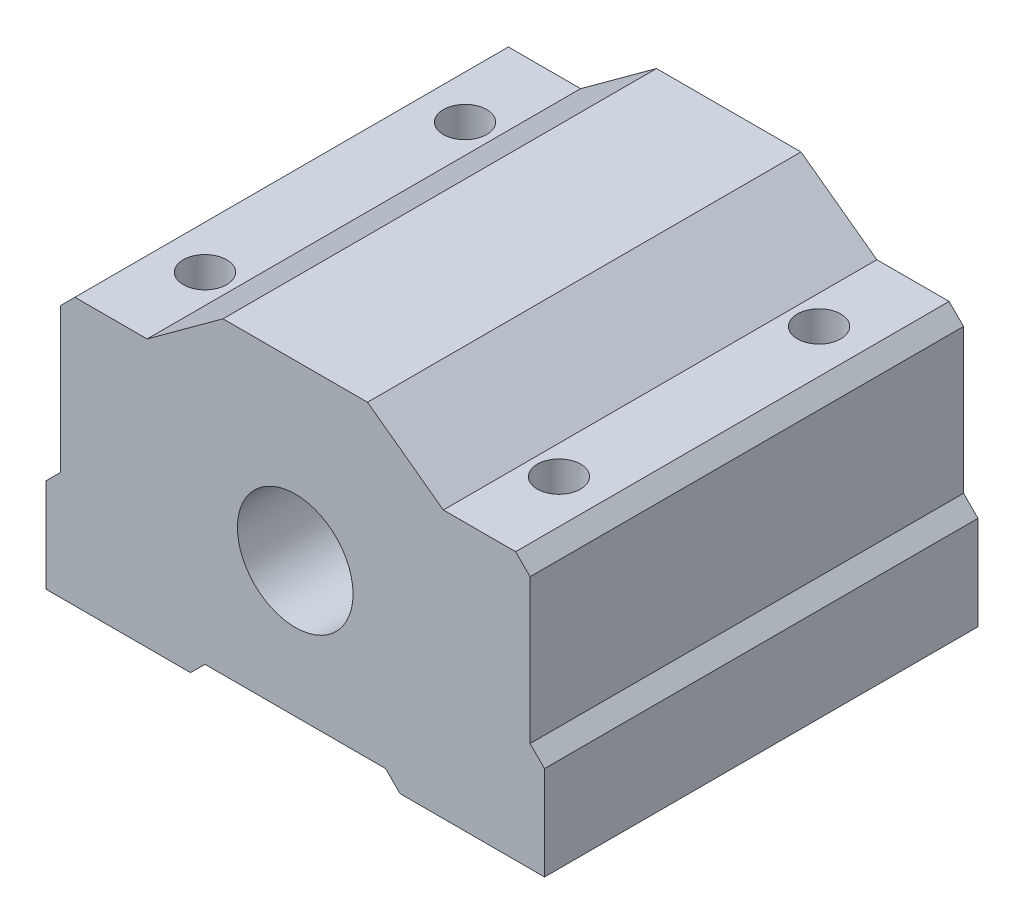
ISO-10303-21;
HEADER;
FILE_DESCRIPTION(('STEP AP214'),'2;1');
FILE_NAME('part.step','',(''),(''),'','','');
FILE_SCHEMA(('AUTOMOTIVE_DESIGN { 1 0 10303 214 1 1 1 1 }'));
ENDSEC;
DATA;
#1=APPLICATION_CONTEXT('core data for automotive mechanical design processes');
#2=APPLICATION_PROTOCOL_DEFINITION('international standard','automotive_design',2000,#1);
#3=PRODUCT_CONTEXT('',#1,'mechanical');
#4=PRODUCT('Part','Part','',(#3));
#5=PRODUCT_RELATED_PRODUCT_CATEGORY('part','',(#4));
#6=PRODUCT_DEFINITION_FORMATION('','',#4);
#7=PRODUCT_DEFINITION_CONTEXT('part definition',#1,'design');
#8=PRODUCT_DEFINITION('design','',#6,#7);
#9=PRODUCT_DEFINITION_SHAPE('','',#8);
#10=(LENGTH_UNIT() NAMED_UNIT(*) SI_UNIT(.MILLI.,.METRE.));
#11=(NAMED_UNIT(*) PLANE_ANGLE_UNIT() SI_UNIT($,.RADIAN.));
#12=(NAMED_UNIT(*) SI_UNIT($,.STERADIAN.) SOLID_ANGLE_UNIT());
#13=UNCERTAINTY_MEASURE_WITH_UNIT(LENGTH_MEASURE(1.E-05),#10,'distance_accuracy_value','');
#14=(GEOMETRIC_REPRESENTATION_CONTEXT(3) GLOBAL_UNCERTAINTY_ASSIGNED_CONTEXT((#13)) GLOBAL_UNIT_ASSIGNED_CONTEXT((#10,
#11,#12)) REPRESENTATION_CONTEXT('',''));
#15=CARTESIAN_POINT('',(0.,0.,0.));
#16=DIRECTION('',(0.,0.,1.));
#17=DIRECTION('',(1.,0.,0.));
#18=AXIS2_PLACEMENT_3D('',#15,#16,#17);
#19=CARTESIAN_POINT('',(-4.99999999999999,21.332427429189,30.));
#20=DIRECTION('',(0.589604219875227,-0.807692307692307,0.));
#21=DIRECTION('',(0.807692307692307,0.589604219875227,0.));
#22=AXIS2_PLACEMENT_3D('',#19,#20,#21);
#23=PLANE('',#22);
#24=DIRECTION('',(-0.807692307692307,-0.589604219875227,0.));
#25=VECTOR('',#24,1.);
#26=CARTESIAN_POINT('',(-4.99999999999999,21.332427429189,0.));
#27=LINE('',#26,#25);
#28=CARTESIAN_POINT('',(-4.99999999999999,21.332427429189,0.));
#29=VERTEX_POINT('',#28);
#30=CARTESIAN_POINT('',(-10.25,17.5,0.));
#31=VERTEX_POINT('',#30);
#32=EDGE_CURVE('E191',#29,#31,#27,.T.);
#33=ORIENTED_EDGE('',*,*,#32,.T.);
#34=DIRECTION('',(0.,0.,-1.));
#35=VECTOR('',#34,1.);
#36=CARTESIAN_POINT('',(-10.25,17.5,30.));
#37=LINE('',#36,#35);
#38=CARTESIAN_POINT('',(-10.25,17.5,30.));
#39=VERTEX_POINT('',#38);
#40=EDGE_CURVE('E11',#39,#31,#37,.T.);
#41=ORIENTED_EDGE('',*,*,#40,.F.);
#42=DIRECTION('',(-0.807692307692307,-0.589604219875227,0.));
#43=VECTOR('',#42,1.);
#44=CARTESIAN_POINT('',(-4.99999999999999,21.332427429189,30.));
#45=LINE('',#44,#43);
#46=CARTESIAN_POINT('',(-4.99999999999999,21.332427429189,30.));
#47=VERTEX_POINT('',#46);
#48=EDGE_CURVE('E227',#47,#39,#45,.T.);
#49=ORIENTED_EDGE('',*,*,#48,.F.);
#50=DIRECTION('',(0.,0.,-1.));
#51=VECTOR('',#50,1.);
#52=CARTESIAN_POINT('',(-4.99999999999999,21.332427429189,30.));
#53=LINE('',#52,#51);
#54=EDGE_CURVE('E187',#47,#29,#53,.T.);
#55=ORIENTED_EDGE('',*,*,#54,.T.);
#56=EDGE_LOOP('',(#33,#41,#49,#55));
#57=FACE_BOUND('',#56,.T.);
#58=ADVANCED_FACE('F35',(#57),#23,.F.);
#59=CARTESIAN_POINT('',(-10.25,17.5,30.));
#60=DIRECTION('',(0.,-1.,0.));
#61=DIRECTION('',(0.,0.,-1.));
#62=AXIS2_PLACEMENT_3D('',#59,#60,#61);
#63=PLANE('',#62);
#64=CARTESIAN_POINT('',(-12.25,17.5,24.));
#65=DIRECTION('',(0.,-1.,0.));
#66=DIRECTION('',(0.,0.,1.));
#67=AXIS2_PLACEMENT_3D('',#64,#65,#66);
#68=CIRCLE('',#67,1.5);
#69=CARTESIAN_POINT('',(-12.25,17.5,25.5));
#70=VERTEX_POINT('',#69);
#71=EDGE_CURVE('E449',#70,#70,#68,.T.);
#72=ORIENTED_EDGE('',*,*,#71,.T.);
#73=EDGE_LOOP('',(#72));
#74=FACE_BOUND('',#73,.T.);
#75=CARTESIAN_POINT('',(-12.25,17.5,6.));
#76=DIRECTION('',(0.,-1.,0.));
#77=DIRECTION('',(0.,0.,1.));
#78=AXIS2_PLACEMENT_3D('',#75,#76,#77);
#79=CIRCLE('',#78,1.5);
#80=CARTESIAN_POINT('',(-12.25,17.5,7.5));
#81=VERTEX_POINT('',#80);
#82=EDGE_CURVE('E451',#81,#81,#79,.T.);
#83=ORIENTED_EDGE('',*,*,#82,.T.);
#84=EDGE_LOOP('',(#83));
#85=FACE_BOUND('',#84,.T.);
#86=DIRECTION('',(-1.,0.,0.));
#87=VECTOR('',#86,1.);
#88=CARTESIAN_POINT('',(-10.25,17.5,0.));
#89=LINE('',#88,#87);
#90=CARTESIAN_POINT('',(-15.25,17.5,0.));
#91=VERTEX_POINT('',#90);
#92=EDGE_CURVE('E194',#31,#91,#89,.T.);
#93=ORIENTED_EDGE('',*,*,#92,.T.);
#94=DIRECTION('',(0.,0.,-1.));
#95=VECTOR('',#94,1.);
#96=CARTESIAN_POINT('',(-15.25,17.5,30.));
#97=LINE('',#96,#95);
#98=CARTESIAN_POINT('',(-15.25,17.5,30.));
#99=VERTEX_POINT('',#98);
#100=EDGE_CURVE('E43',#99,#91,#97,.T.);
#101=ORIENTED_EDGE('',*,*,#100,.F.);
#102=DIRECTION('',(-1.,0.,0.));
#103=VECTOR('',#102,1.);
#104=CARTESIAN_POINT('',(-10.25,17.5,30.));
#105=LINE('',#104,#103);
#106=EDGE_CURVE('E124',#39,#99,#105,.T.);
#107=ORIENTED_EDGE('',*,*,#106,.F.);
#108=ORIENTED_EDGE('',*,*,#40,.T.);
#109=EDGE_LOOP('',(#93,#101,#107,#108));
#110=FACE_BOUND('',#109,.T.);
#111=ADVANCED_FACE('F336',(#74,#85,#110),#63,.F.);
#112=CARTESIAN_POINT('',(-15.25,17.5,30.));
#113=DIRECTION('',(0.707106781186549,-0.707106781186546,0.));
#114=DIRECTION('',(0.707106781186546,0.707106781186549,0.));
#115=AXIS2_PLACEMENT_3D('',#112,#113,#114);
#116=PLANE('',#115);
#117=DIRECTION('',(-0.707106781186546,-0.707106781186549,0.));
#118=VECTOR('',#117,1.);
#119=CARTESIAN_POINT('',(-15.25,17.5,0.));
#120=LINE('',#119,#118);
#121=CARTESIAN_POINT('',(-16.25,16.5,0.));
#122=VERTEX_POINT('',#121);
#123=EDGE_CURVE('E197',#91,#122,#120,.T.);
#124=ORIENTED_EDGE('',*,*,#123,.T.);
#125=DIRECTION('',(0.,0.,-1.));
#126=VECTOR('',#125,1.);
#127=CARTESIAN_POINT('',(-16.25,16.5,30.));
#128=LINE('',#127,#126);
#129=CARTESIAN_POINT('',(-16.25,16.5,30.));
#130=VERTEX_POINT('',#129);
#131=EDGE_CURVE('E264',#130,#122,#128,.T.);
#132=ORIENTED_EDGE('',*,*,#131,.F.);
#133=DIRECTION('',(-0.707106781186546,-0.707106781186549,0.));
#134=VECTOR('',#133,1.);
#135=CARTESIAN_POINT('',(-15.25,17.5,30.));
#136=LINE('',#135,#134);
#137=EDGE_CURVE('E272',#99,#130,#136,.T.);
#138=ORIENTED_EDGE('',*,*,#137,.F.);
#139=ORIENTED_EDGE('',*,*,#100,.T.);
#140=EDGE_LOOP('',(#124,#132,#138,#139));
#141=FACE_BOUND('',#140,.T.);
#142=ADVANCED_FACE('F270',(#141),#116,.F.);
#143=CARTESIAN_POINT('',(-16.25,16.5,30.));
#144=DIRECTION('',(1.,0.,0.));
#145=DIRECTION('',(0.,1.,0.));
#146=AXIS2_PLACEMENT_3D('',#143,#144,#145);
#147=PLANE('',#146);
#148=DIRECTION('',(0.,-1.,0.));
#149=VECTOR('',#148,1.);
#150=CARTESIAN_POINT('',(-16.25,16.5,0.));
#151=LINE('',#150,#149);
#152=CARTESIAN_POINT('',(-16.25,6.50000000000001,0.));
#153=VERTEX_POINT('',#152);
#154=EDGE_CURVE('E199',#122,#153,#151,.T.);
#155=ORIENTED_EDGE('',*,*,#154,.T.);
#156=DIRECTION('',(0.,0.,-1.));
#157=VECTOR('',#156,1.);
#158=CARTESIAN_POINT('',(-16.25,6.50000000000001,30.));
#159=LINE('',#158,#157);
#160=CARTESIAN_POINT('',(-16.25,6.50000000000001,30.));
#161=VERTEX_POINT('',#160);
#162=EDGE_CURVE('E261',#161,#153,#159,.T.);
#163=ORIENTED_EDGE('',*,*,#162,.F.);
#164=DIRECTION('',(0.,-1.,0.));
#165=VECTOR('',#164,1.);
#166=CARTESIAN_POINT('',(-16.25,16.5,30.));
#167=LINE('',#166,#165);
#168=EDGE_CURVE('E290',#130,#161,#167,.T.);
#169=ORIENTED_EDGE('',*,*,#168,.F.);
#170=ORIENTED_EDGE('',*,*,#131,.T.);
#171=EDGE_LOOP('',(#155,#163,#169,#170));
#172=FACE_BOUND('',#171,.T.);
#173=ADVANCED_FACE('F281',(#172),#147,.F.);
#174=CARTESIAN_POINT('',(-16.25,6.50000000000001,30.));
#175=DIRECTION('',(0.70710678118655,-0.707106781186545,0.));
#176=DIRECTION('',(0.707106781186545,0.70710678118655,0.));
#177=AXIS2_PLACEMENT_3D('',#174,#175,#176);
#178=PLANE('',#177);
#179=DIRECTION('',(-0.707106781186545,-0.70710678118655,0.));
#180=VECTOR('',#179,1.);
#181=CARTESIAN_POINT('',(-16.25,6.50000000000001,0.));
#182=LINE('',#181,#180);
#183=CARTESIAN_POINT('',(-17.25,5.5,0.));
#184=VERTEX_POINT('',#183);
#185=EDGE_CURVE('E201',#153,#184,#182,.T.);
#186=ORIENTED_EDGE('',*,*,#185,.T.);
#187=DIRECTION('',(0.,0.,-1.));
#188=VECTOR('',#187,1.);
#189=CARTESIAN_POINT('',(-17.25,5.5,30.));
#190=LINE('',#189,#188);
#191=CARTESIAN_POINT('',(-17.25,5.5,30.));
#192=VERTEX_POINT('',#191);
#193=EDGE_CURVE('E258',#192,#184,#190,.T.);
#194=ORIENTED_EDGE('',*,*,#193,.F.);
#195=DIRECTION('',(-0.707106781186545,-0.70710678118655,0.));
#196=VECTOR('',#195,1.);
#197=CARTESIAN_POINT('',(-16.25,6.50000000000001,30.));
#198=LINE('',#197,#196);
#199=EDGE_CURVE('E287',#161,#192,#198,.T.);
#200=ORIENTED_EDGE('',*,*,#199,.F.);
#201=ORIENTED_EDGE('',*,*,#162,.T.);
#202=EDGE_LOOP('',(#186,#194,#200,#201));
#203=FACE_BOUND('',#202,.T.);
#204=ADVANCED_FACE('F285',(#203),#178,.F.);
#205=CARTESIAN_POINT('',(-17.25,5.5,30.));
#206=DIRECTION('',(1.,0.,0.));
#207=DIRECTION('',(0.,1.,0.));
#208=AXIS2_PLACEMENT_3D('',#205,#206,#207);
#209=PLANE('',#208);
#210=DIRECTION('',(0.,-1.,0.));
#211=VECTOR('',#210,1.);
#212=CARTESIAN_POINT('',(-17.25,5.5,0.));
#213=LINE('',#212,#211);
#214=CARTESIAN_POINT('',(-17.25,-1.,0.));
#215=VERTEX_POINT('',#214);
#216=EDGE_CURVE('E203',#184,#215,#213,.T.);
#217=ORIENTED_EDGE('',*,*,#216,.T.);
#218=DIRECTION('',(0.,0.,-1.));
#219=VECTOR('',#218,1.);
#220=CARTESIAN_POINT('',(-17.25,-1.,30.));
#221=LINE('',#220,#219);
#222=CARTESIAN_POINT('',(-17.25,-1.,30.));
#223=VERTEX_POINT('',#222);
#224=EDGE_CURVE('E255',#223,#215,#221,.T.);
#225=ORIENTED_EDGE('',*,*,#224,.F.);
#226=DIRECTION('',(0.,-1.,0.));
#227=VECTOR('',#226,1.);
#228=CARTESIAN_POINT('',(-17.25,5.5,30.));
#229=LINE('',#228,#227);
#230=EDGE_CURVE('E289',#192,#223,#229,.T.);
#231=ORIENTED_EDGE('',*,*,#230,.F.);
#232=ORIENTED_EDGE('',*,*,#193,.T.);
#233=EDGE_LOOP('',(#217,#225,#231,#232));
#234=FACE_BOUND('',#233,.T.);
#235=ADVANCED_FACE('F352',(#234),#209,.F.);
#236=CARTESIAN_POINT('',(-17.25,-1.,30.));
#237=DIRECTION('',(0.,1.,0.));
#238=DIRECTION('',(0.,0.,1.));
#239=AXIS2_PLACEMENT_3D('',#236,#237,#238);
#240=PLANE('',#239);
#241=CARTESIAN_POINT('',(-12.25,-1.,24.));
#242=DIRECTION('',(0.,-1.,0.));
#243=DIRECTION('',(0.,0.,1.));
#244=AXIS2_PLACEMENT_3D('',#241,#242,#243);
#245=CIRCLE('',#244,1.5);
#246=CARTESIAN_POINT('',(-12.25,-1.,25.5));
#247=VERTEX_POINT('',#246);
#248=EDGE_CURVE('E447',#247,#247,#245,.T.);
#249=ORIENTED_EDGE('',*,*,#248,.F.);
#250=EDGE_LOOP('',(#249));
#251=FACE_BOUND('',#250,.T.);
#252=CARTESIAN_POINT('',(-12.25,-1.,6.));
#253=DIRECTION('',(0.,-1.,0.));
#254=DIRECTION('',(0.,0.,1.));
#255=AXIS2_PLACEMENT_3D('',#252,#253,#254);
#256=CIRCLE('',#255,1.5);
#257=CARTESIAN_POINT('',(-12.25,-1.,7.5));
#258=VERTEX_POINT('',#257);
#259=EDGE_CURVE('E454',#258,#258,#256,.T.);
#260=ORIENTED_EDGE('',*,*,#259,.F.);
#261=EDGE_LOOP('',(#260));
#262=FACE_BOUND('',#261,.T.);
#263=DIRECTION('',(1.,0.,0.));
#264=VECTOR('',#263,1.);
#265=CARTESIAN_POINT('',(-17.25,-1.,0.));
#266=LINE('',#265,#264);
#267=CARTESIAN_POINT('',(-7.25,-1.,0.));
#268=VERTEX_POINT('',#267);
#269=EDGE_CURVE('E205',#215,#268,#266,.T.);
#270=ORIENTED_EDGE('',*,*,#269,.T.);
#271=DIRECTION('',(0.,0.,-1.));
#272=VECTOR('',#271,1.);
#273=CARTESIAN_POINT('',(-7.25,-1.,30.));
#274=LINE('',#273,#272);
#275=CARTESIAN_POINT('',(-7.25,-1.,30.));
#276=VERTEX_POINT('',#275);
#277=EDGE_CURVE('E252',#276,#268,#274,.T.);
#278=ORIENTED_EDGE('',*,*,#277,.F.);
#279=DIRECTION('',(1.,0.,0.));
#280=VECTOR('',#279,1.);
#281=CARTESIAN_POINT('',(-17.25,-1.,30.));
#282=LINE('',#281,#280);
#283=EDGE_CURVE('E292',#223,#276,#282,.T.);
#284=ORIENTED_EDGE('',*,*,#283,.F.);
#285=ORIENTED_EDGE('',*,*,#224,.T.);
#286=EDGE_LOOP('',(#270,#278,#284,#285));
#287=FACE_BOUND('',#286,.T.);
#288=ADVANCED_FACE('F355',(#251,#262,#287),#240,.F.);
#289=CARTESIAN_POINT('',(-7.25,-1.,30.));
#290=DIRECTION('',(-0.707106781186549,0.707106781186546,0.));
#291=DIRECTION('',(-0.707106781186546,-0.707106781186549,0.));
#292=AXIS2_PLACEMENT_3D('',#289,#290,#291);
#293=PLANE('',#292);
#294=DIRECTION('',(0.707106781186546,0.707106781186549,0.));
#295=VECTOR('',#294,1.);
#296=CARTESIAN_POINT('',(-7.25,-1.,0.));
#297=LINE('',#296,#295);
#298=CARTESIAN_POINT('',(-6.25,0.,0.));
#299=VERTEX_POINT('',#298);
#300=EDGE_CURVE('E207',#268,#299,#297,.T.);
#301=ORIENTED_EDGE('',*,*,#300,.T.);
#302=DIRECTION('',(0.,0.,-1.));
#303=VECTOR('',#302,1.);
#304=CARTESIAN_POINT('',(-6.25,0.,30.));
#305=LINE('',#304,#303);
#306=CARTESIAN_POINT('',(-6.25,0.,30.));
#307=VERTEX_POINT('',#306);
#308=EDGE_CURVE('E249',#307,#299,#305,.T.);
#309=ORIENTED_EDGE('',*,*,#308,.F.);
#310=DIRECTION('',(0.707106781186546,0.707106781186549,0.));
#311=VECTOR('',#310,1.);
#312=CARTESIAN_POINT('',(-7.25,-1.,30.));
#313=LINE('',#312,#311);
#314=EDGE_CURVE('E298',#276,#307,#313,.T.);
#315=ORIENTED_EDGE('',*,*,#314,.F.);
#316=ORIENTED_EDGE('',*,*,#277,.T.);
#317=EDGE_LOOP('',(#301,#309,#315,#316));
#318=FACE_BOUND('',#317,.T.);
#319=ADVANCED_FACE('F359',(#318),#293,.F.);
#320=CARTESIAN_POINT('',(0.,0.,30.));
#321=DIRECTION('',(0.,1.,0.));
#322=DIRECTION('',(0.,0.,1.));
#323=AXIS2_PLACEMENT_3D('',#320,#321,#322);
#324=PLANE('',#323);
#325=DIRECTION('',(1.,0.,0.));
#326=VECTOR('',#325,1.);
#327=CARTESIAN_POINT('',(0.,0.,0.));
#328=LINE('',#327,#326);
#329=CARTESIAN_POINT('',(6.25,0.,0.));
#330=VERTEX_POINT('',#329);
#331=EDGE_CURVE('E210',#299,#330,#328,.T.);
#332=ORIENTED_EDGE('',*,*,#331,.T.);
#333=DIRECTION('',(0.,0.,-1.));
#334=VECTOR('',#333,1.);
#335=CARTESIAN_POINT('',(6.25,0.,30.));
#336=LINE('',#335,#334);
#337=CARTESIAN_POINT('',(6.25,0.,30.));
#338=VERTEX_POINT('',#337);
#339=EDGE_CURVE('E246',#338,#330,#336,.T.);
#340=ORIENTED_EDGE('',*,*,#339,.F.);
#341=DIRECTION('',(1.,0.,0.));
#342=VECTOR('',#341,1.);
#343=CARTESIAN_POINT('',(-6.25,0.,30.));
#344=LINE('',#343,#342);
#345=EDGE_CURVE('E300',#307,#338,#344,.T.);
#346=ORIENTED_EDGE('',*,*,#345,.F.);
#347=ORIENTED_EDGE('',*,*,#308,.T.);
#348=EDGE_LOOP('',(#332,#340,#346,#347));
#349=FACE_BOUND('',#348,.T.);
#350=ADVANCED_FACE('F363',(#349),#324,.F.);
#351=CARTESIAN_POINT('',(6.25,0.,30.));
#352=DIRECTION('',(0.707106781186548,0.707106781186547,0.));
#353=DIRECTION('',(-0.707106781186547,0.707106781186548,0.));
#354=AXIS2_PLACEMENT_3D('',#351,#352,#353);
#355=PLANE('',#354);
#356=DIRECTION('',(0.707106781186547,-0.707106781186548,0.));
#357=VECTOR('',#356,1.);
#358=CARTESIAN_POINT('',(6.25,0.,0.));
#359=LINE('',#358,#357);
#360=CARTESIAN_POINT('',(7.25,-1.,0.));
#361=VERTEX_POINT('',#360);
#362=EDGE_CURVE('E212',#330,#361,#359,.T.);
#363=ORIENTED_EDGE('',*,*,#362,.T.);
#364=DIRECTION('',(0.,0.,-1.));
#365=VECTOR('',#364,1.);
#366=CARTESIAN_POINT('',(7.25,-1.,30.));
#367=LINE('',#366,#365);
#368=CARTESIAN_POINT('',(7.25,-1.,30.));
#369=VERTEX_POINT('',#368);
#370=EDGE_CURVE('E243',#369,#361,#367,.T.);
#371=ORIENTED_EDGE('',*,*,#370,.F.);
#372=DIRECTION('',(0.707106781186547,-0.707106781186548,0.));
#373=VECTOR('',#372,1.);
#374=CARTESIAN_POINT('',(6.25,0.,30.));
#375=LINE('',#374,#373);
#376=EDGE_CURVE('E302',#338,#369,#375,.T.);
#377=ORIENTED_EDGE('',*,*,#376,.F.);
#378=ORIENTED_EDGE('',*,*,#339,.T.);
#379=EDGE_LOOP('',(#363,#371,#377,#378));
#380=FACE_BOUND('',#379,.T.);
#381=ADVANCED_FACE('F367',(#380),#355,.F.);
#382=CARTESIAN_POINT('',(7.25,-1.,30.));
#383=DIRECTION('',(0.,1.,0.));
#384=DIRECTION('',(-1.,0.,0.));
#385=AXIS2_PLACEMENT_3D('',#382,#383,#384);
#386=PLANE('',#385);
#387=CARTESIAN_POINT('',(12.25,-1.,24.));
#388=DIRECTION('',(0.,1.,0.));
#389=DIRECTION('',(0.,0.,1.));
#390=AXIS2_PLACEMENT_3D('',#387,#388,#389);
#391=CIRCLE('',#390,1.5);
#392=CARTESIAN_POINT('',(12.25,-1.,25.5));
#393=VERTEX_POINT('',#392);
#394=EDGE_CURVE('E401',#393,#393,#391,.T.);
#395=ORIENTED_EDGE('',*,*,#394,.T.);
#396=EDGE_LOOP('',(#395));
#397=FACE_BOUND('',#396,.T.);
#398=CARTESIAN_POINT('',(12.25,-1.,6.));
#399=DIRECTION('',(0.,1.,0.));
#400=DIRECTION('',(0.,0.,1.));
#401=AXIS2_PLACEMENT_3D('',#398,#399,#400);
#402=CIRCLE('',#401,1.5);
#403=CARTESIAN_POINT('',(12.25,-1.,7.5));
#404=VERTEX_POINT('',#403);
#405=EDGE_CURVE('E400',#404,#404,#402,.T.);
#406=ORIENTED_EDGE('',*,*,#405,.T.);
#407=EDGE_LOOP('',(#406));
#408=FACE_BOUND('',#407,.T.);
#409=DIRECTION('',(1.,0.,0.));
#410=VECTOR('',#409,1.);
#411=CARTESIAN_POINT('',(7.25,-1.,0.));
#412=LINE('',#411,#410);
#413=CARTESIAN_POINT('',(17.25,-1.,0.));
#414=VERTEX_POINT('',#413);
#415=EDGE_CURVE('E214',#361,#414,#412,.T.);
#416=ORIENTED_EDGE('',*,*,#415,.T.);
#417=DIRECTION('',(0.,0.,-1.));
#418=VECTOR('',#417,1.);
#419=CARTESIAN_POINT('',(17.25,-1.,30.));
#420=LINE('',#419,#418);
#421=CARTESIAN_POINT('',(17.25,-1.,30.));
#422=VERTEX_POINT('',#421);
#423=EDGE_CURVE('E240',#422,#414,#420,.T.);
#424=ORIENTED_EDGE('',*,*,#423,.F.);
#425=DIRECTION('',(1.,0.,0.));
#426=VECTOR('',#425,1.);
#427=CARTESIAN_POINT('',(7.25,-1.,30.));
#428=LINE('',#427,#426);
#429=EDGE_CURVE('E304',#369,#422,#428,.T.);
#430=ORIENTED_EDGE('',*,*,#429,.F.);
#431=ORIENTED_EDGE('',*,*,#370,.T.);
#432=EDGE_LOOP('',(#416,#424,#430,#431));
#433=FACE_BOUND('',#432,.T.);
#434=ADVANCED_FACE('F371',(#397,#408,#433),#386,.F.);
#435=CARTESIAN_POINT('',(17.25,-1.,30.));
#436=DIRECTION('',(-1.,0.,0.));
#437=DIRECTION('',(0.,-1.,0.));
#438=AXIS2_PLACEMENT_3D('',#435,#436,#437);
#439=PLANE('',#438);
#440=DIRECTION('',(0.,1.,0.));
#441=VECTOR('',#440,1.);
#442=CARTESIAN_POINT('',(17.25,-1.,0.));
#443=LINE('',#442,#441);
#444=CARTESIAN_POINT('',(17.25,5.5,0.));
#445=VERTEX_POINT('',#444);
#446=EDGE_CURVE('E216',#414,#445,#443,.T.);
#447=ORIENTED_EDGE('',*,*,#446,.T.);
#448=DIRECTION('',(0.,0.,-1.));
#449=VECTOR('',#448,1.);
#450=CARTESIAN_POINT('',(17.25,5.5,30.));
#451=LINE('',#450,#449);
#452=CARTESIAN_POINT('',(17.25,5.5,30.));
#453=VERTEX_POINT('',#452);
#454=EDGE_CURVE('E237',#453,#445,#451,.T.);
#455=ORIENTED_EDGE('',*,*,#454,.F.);
#456=DIRECTION('',(0.,1.,0.));
#457=VECTOR('',#456,1.);
#458=CARTESIAN_POINT('',(17.25,-1.,30.));
#459=LINE('',#458,#457);
#460=EDGE_CURVE('E306',#422,#453,#459,.T.);
#461=ORIENTED_EDGE('',*,*,#460,.F.);
#462=ORIENTED_EDGE('',*,*,#423,.T.);
#463=EDGE_LOOP('',(#447,#455,#461,#462));
#464=FACE_BOUND('',#463,.T.);
#465=ADVANCED_FACE('F375',(#464),#439,.F.);
#466=CARTESIAN_POINT('',(17.25,5.5,30.));
#467=DIRECTION('',(-0.707106781186549,-0.707106781186546,0.));
#468=DIRECTION('',(0.707106781186546,-0.707106781186549,0.));
#469=AXIS2_PLACEMENT_3D('',#466,#467,#468);
#470=PLANE('',#469);
#471=DIRECTION('',(-0.707106781186546,0.707106781186549,0.));
#472=VECTOR('',#471,1.);
#473=CARTESIAN_POINT('',(17.25,5.5,0.));
#474=LINE('',#473,#472);
#475=CARTESIAN_POINT('',(16.25,6.50000000000001,0.));
#476=VERTEX_POINT('',#475);
#477=EDGE_CURVE('E218',#445,#476,#474,.T.);
#478=ORIENTED_EDGE('',*,*,#477,.T.);
#479=DIRECTION('',(0.,0.,-1.));
#480=VECTOR('',#479,1.);
#481=CARTESIAN_POINT('',(16.25,6.50000000000001,30.));
#482=LINE('',#481,#480);
#483=CARTESIAN_POINT('',(16.25,6.50000000000001,30.));
#484=VERTEX_POINT('',#483);
#485=EDGE_CURVE('E234',#484,#476,#482,.T.);
#486=ORIENTED_EDGE('',*,*,#485,.F.);
#487=DIRECTION('',(-0.707106781186546,0.707106781186549,0.));
#488=VECTOR('',#487,1.);
#489=CARTESIAN_POINT('',(17.25,5.5,30.));
#490=LINE('',#489,#488);
#491=EDGE_CURVE('E308',#453,#484,#490,.T.);
#492=ORIENTED_EDGE('',*,*,#491,.F.);
#493=ORIENTED_EDGE('',*,*,#454,.T.);
#494=EDGE_LOOP('',(#478,#486,#492,#493));
#495=FACE_BOUND('',#494,.T.);
#496=ADVANCED_FACE('F379',(#495),#470,.F.);
#497=CARTESIAN_POINT('',(16.25,6.50000000000001,30.));
#498=DIRECTION('',(-1.,0.,0.));
#499=DIRECTION('',(0.,-1.,0.));
#500=AXIS2_PLACEMENT_3D('',#497,#498,#499);
#501=PLANE('',#500);
#502=DIRECTION('',(0.,1.,0.));
#503=VECTOR('',#502,1.);
#504=CARTESIAN_POINT('',(16.25,6.50000000000001,0.));
#505=LINE('',#504,#503);
#506=CARTESIAN_POINT('',(16.25,16.5,0.));
#507=VERTEX_POINT('',#506);
#508=EDGE_CURVE('E220',#476,#507,#505,.T.);
#509=ORIENTED_EDGE('',*,*,#508,.T.);
#510=DIRECTION('',(0.,0.,-1.));
#511=VECTOR('',#510,1.);
#512=CARTESIAN_POINT('',(16.25,16.5,30.));
#513=LINE('',#512,#511);
#514=CARTESIAN_POINT('',(16.25,16.5,30.));
#515=VERTEX_POINT('',#514);
#516=EDGE_CURVE('E231',#515,#507,#513,.T.);
#517=ORIENTED_EDGE('',*,*,#516,.F.);
#518=DIRECTION('',(0.,1.,0.));
#519=VECTOR('',#518,1.);
#520=CARTESIAN_POINT('',(16.25,6.50000000000001,30.));
#521=LINE('',#520,#519);
#522=EDGE_CURVE('E310',#484,#515,#521,.T.);
#523=ORIENTED_EDGE('',*,*,#522,.F.);
#524=ORIENTED_EDGE('',*,*,#485,.T.);
#525=EDGE_LOOP('',(#509,#517,#523,#524));
#526=FACE_BOUND('',#525,.T.);
#527=ADVANCED_FACE('F316',(#526),#501,.F.);
#528=CARTESIAN_POINT('',(16.25,16.5,30.));
#529=DIRECTION('',(-0.70710678118655,-0.707106781186545,0.));
#530=DIRECTION('',(0.707106781186545,-0.70710678118655,0.));
#531=AXIS2_PLACEMENT_3D('',#528,#529,#530);
#532=PLANE('',#531);
#533=DIRECTION('',(-0.707106781186545,0.70710678118655,0.));
#534=VECTOR('',#533,1.);
#535=CARTESIAN_POINT('',(16.25,16.5,0.));
#536=LINE('',#535,#534);
#537=CARTESIAN_POINT('',(15.25,17.5,0.));
#538=VERTEX_POINT('',#537);
#539=EDGE_CURVE('E222',#507,#538,#536,.T.);
#540=ORIENTED_EDGE('',*,*,#539,.T.);
#541=DIRECTION('',(0.,0.,-1.));
#542=VECTOR('',#541,1.);
#543=CARTESIAN_POINT('',(15.25,17.5,30.));
#544=LINE('',#543,#542);
#545=CARTESIAN_POINT('',(15.25,17.5,30.));
#546=VERTEX_POINT('',#545);
#547=EDGE_CURVE('E182',#546,#538,#544,.T.);
#548=ORIENTED_EDGE('',*,*,#547,.F.);
#549=DIRECTION('',(-0.707106781186545,0.70710678118655,0.));
#550=VECTOR('',#549,1.);
#551=CARTESIAN_POINT('',(16.25,16.5,30.));
#552=LINE('',#551,#550);
#553=EDGE_CURVE('E173',#515,#546,#552,.T.);
#554=ORIENTED_EDGE('',*,*,#553,.F.);
#555=ORIENTED_EDGE('',*,*,#516,.T.);
#556=EDGE_LOOP('',(#540,#548,#554,#555));
#557=FACE_BOUND('',#556,.T.);
#558=ADVANCED_FACE('F320',(#557),#532,.F.);
#559=CARTESIAN_POINT('',(15.25,17.5,30.));
#560=DIRECTION('',(0.,-1.,0.));
#561=DIRECTION('',(0.,0.,-1.));
#562=AXIS2_PLACEMENT_3D('',#559,#560,#561);
#563=PLANE('',#562);
#564=CARTESIAN_POINT('',(12.25,17.5,24.));
#565=DIRECTION('',(0.,1.,0.));
#566=DIRECTION('',(0.,0.,1.));
#567=AXIS2_PLACEMENT_3D('',#564,#565,#566);
#568=CIRCLE('',#567,1.5);
#569=CARTESIAN_POINT('',(12.25,17.5,25.5));
#570=VERTEX_POINT('',#569);
#571=EDGE_CURVE('E395',#570,#570,#568,.T.);
#572=ORIENTED_EDGE('',*,*,#571,.F.);
#573=EDGE_LOOP('',(#572));
#574=FACE_BOUND('',#573,.T.);
#575=CARTESIAN_POINT('',(12.25,17.5,6.));
#576=DIRECTION('',(0.,1.,0.));
#577=DIRECTION('',(0.,0.,1.));
#578=AXIS2_PLACEMENT_3D('',#575,#576,#577);
#579=CIRCLE('',#578,1.5);
#580=CARTESIAN_POINT('',(12.25,17.5,7.5));
#581=VERTEX_POINT('',#580);
#582=EDGE_CURVE('E398',#581,#581,#579,.T.);
#583=ORIENTED_EDGE('',*,*,#582,.F.);
#584=EDGE_LOOP('',(#583));
#585=FACE_BOUND('',#584,.T.);
#586=DIRECTION('',(-1.,0.,0.));
#587=VECTOR('',#586,1.);
#588=CARTESIAN_POINT('',(15.25,17.5,0.));
#589=LINE('',#588,#587);
#590=CARTESIAN_POINT('',(10.25,17.5,0.));
#591=VERTEX_POINT('',#590);
#592=EDGE_CURVE('E181',#538,#591,#589,.T.);
#593=ORIENTED_EDGE('',*,*,#592,.T.);
#594=DIRECTION('',(0.,0.,-1.));
#595=VECTOR('',#594,1.);
#596=CARTESIAN_POINT('',(10.25,17.5,30.));
#597=LINE('',#596,#595);
#598=CARTESIAN_POINT('',(10.25,17.5,30.));
#599=VERTEX_POINT('',#598);
#600=EDGE_CURVE('E178',#599,#591,#597,.T.);
#601=ORIENTED_EDGE('',*,*,#600,.F.);
#602=DIRECTION('',(-1.,0.,0.));
#603=VECTOR('',#602,1.);
#604=CARTESIAN_POINT('',(15.25,17.5,30.));
#605=LINE('',#604,#603);
#606=EDGE_CURVE('E167',#546,#599,#605,.T.);
#607=ORIENTED_EDGE('',*,*,#606,.F.);
#608=ORIENTED_EDGE('',*,*,#547,.T.);
#609=EDGE_LOOP('',(#593,#601,#607,#608));
#610=FACE_BOUND('',#609,.T.);
#611=ADVANCED_FACE('F179',(#574,#585,#610),#563,.F.);
#612=CARTESIAN_POINT('',(10.25,17.5,30.));
#613=DIRECTION('',(-0.589604219875227,-0.807692307692308,0.));
#614=DIRECTION('',(0.807692307692308,-0.589604219875227,0.));
#615=AXIS2_PLACEMENT_3D('',#612,#613,#614);
#616=PLANE('',#615);
#617=DIRECTION('',(-0.807692307692308,0.589604219875227,0.));
#618=VECTOR('',#617,1.);
#619=CARTESIAN_POINT('',(10.25,17.5,0.));
#620=LINE('',#619,#618);
#621=CARTESIAN_POINT('',(5.00000000000001,21.332427429189,0.));
#622=VERTEX_POINT('',#621);
#623=EDGE_CURVE('E110',#591,#622,#620,.T.);
#624=ORIENTED_EDGE('',*,*,#623,.T.);
#625=DIRECTION('',(0.,0.,-1.));
#626=VECTOR('',#625,1.);
#627=CARTESIAN_POINT('',(5.00000000000001,21.332427429189,30.));
#628=LINE('',#627,#626);
#629=CARTESIAN_POINT('',(5.00000000000001,21.332427429189,30.));
#630=VERTEX_POINT('',#629);
#631=EDGE_CURVE('E183',#630,#622,#628,.T.);
#632=ORIENTED_EDGE('',*,*,#631,.F.);
#633=DIRECTION('',(-0.807692307692308,0.589604219875227,0.));
#634=VECTOR('',#633,1.);
#635=CARTESIAN_POINT('',(10.25,17.5,30.));
#636=LINE('',#635,#634);
#637=EDGE_CURVE('E171',#599,#630,#636,.T.);
#638=ORIENTED_EDGE('',*,*,#637,.F.);
#639=ORIENTED_EDGE('',*,*,#600,.T.);
#640=EDGE_LOOP('',(#624,#632,#638,#639));
#641=FACE_BOUND('',#640,.T.);
#642=ADVANCED_FACE('F185',(#641),#616,.F.);
#643=CARTESIAN_POINT('',(5.00000000000001,21.332427429189,30.));
#644=DIRECTION('',(0.,-1.,0.));
#645=DIRECTION('',(0.,0.,-1.));
#646=AXIS2_PLACEMENT_3D('',#643,#644,#645);
#647=PLANE('',#646);
#648=DIRECTION('',(-1.,0.,0.));
#649=VECTOR('',#648,1.);
#650=CARTESIAN_POINT('',(5.00000000000001,21.332427429189,0.));
#651=LINE('',#650,#649);
#652=EDGE_CURVE('E116',#622,#29,#651,.T.);
#653=ORIENTED_EDGE('',*,*,#652,.T.);
#654=ORIENTED_EDGE('',*,*,#54,.F.);
#655=DIRECTION('',(-1.,0.,0.));
#656=VECTOR('',#655,1.);
#657=CARTESIAN_POINT('',(5.00000000000001,21.332427429189,30.));
#658=LINE('',#657,#656);
#659=EDGE_CURVE('E51',#630,#47,#658,.T.);
#660=ORIENTED_EDGE('',*,*,#659,.F.);
#661=ORIENTED_EDGE('',*,*,#631,.T.);
#662=EDGE_LOOP('',(#653,#654,#660,#661));
#663=FACE_BOUND('',#662,.T.);
#664=ADVANCED_FACE('F324',(#663),#647,.F.);
#665=CARTESIAN_POINT('',(0.,0.,30.));
#666=DIRECTION('',(0.,0.,1.));
#667=DIRECTION('',(1.,0.,0.));
#668=AXIS2_PLACEMENT_3D('',#665,#666,#667);
#669=PLANE('',#668);
#670=CARTESIAN_POINT('',(0.,9.33242742918898,30.));
#671=DIRECTION('',(0.,0.,1.));
#672=DIRECTION('',(1.,0.,0.));
#673=AXIS2_PLACEMENT_3D('',#670,#671,#672);
#674=CIRCLE('',#673,4.);
#675=CARTESIAN_POINT('',(4.,9.33242742918898,30.));
#676=VERTEX_POINT('',#675);
#677=EDGE_CURVE('E404',#676,#676,#674,.T.);
#678=ORIENTED_EDGE('',*,*,#677,.F.);
#679=EDGE_LOOP('',(#678));
#680=FACE_BOUND('',#679,.T.);
#681=ORIENTED_EDGE('',*,*,#48,.T.);
#682=ORIENTED_EDGE('',*,*,#106,.T.);
#683=ORIENTED_EDGE('',*,*,#137,.T.);
#684=ORIENTED_EDGE('',*,*,#168,.T.);
#685=ORIENTED_EDGE('',*,*,#199,.T.);
#686=ORIENTED_EDGE('',*,*,#230,.T.);
#687=ORIENTED_EDGE('',*,*,#283,.T.);
#688=ORIENTED_EDGE('',*,*,#314,.T.);
#689=ORIENTED_EDGE('',*,*,#345,.T.);
#690=ORIENTED_EDGE('',*,*,#376,.T.);
#691=ORIENTED_EDGE('',*,*,#429,.T.);
#692=ORIENTED_EDGE('',*,*,#460,.T.);
#693=ORIENTED_EDGE('',*,*,#491,.T.);
#694=ORIENTED_EDGE('',*,*,#522,.T.);
#695=ORIENTED_EDGE('',*,*,#553,.T.);
#696=ORIENTED_EDGE('',*,*,#606,.T.);
#697=ORIENTED_EDGE('',*,*,#637,.T.);
#698=ORIENTED_EDGE('',*,*,#659,.T.);
#699=EDGE_LOOP('',(#681,#682,#683,#684,#685,#686,#687,#688,#689,#690,#691,#692,#693,#694,#695,
#696,#697,#698));
#700=FACE_BOUND('',#699,.T.);
#701=ADVANCED_FACE('F169',(#680,#700),#669,.T.);
#702=CARTESIAN_POINT('',(0.,0.,0.));
#703=DIRECTION('',(0.,0.,1.));
#704=DIRECTION('',(1.,0.,0.));
#705=AXIS2_PLACEMENT_3D('',#702,#703,#704);
#706=PLANE('',#705);
#707=CARTESIAN_POINT('',(0.,9.33242742918898,0.));
#708=DIRECTION('',(0.,0.,1.));
#709=DIRECTION('',(1.,0.,0.));
#710=AXIS2_PLACEMENT_3D('',#707,#708,#709);
#711=CIRCLE('',#710,4.);
#712=CARTESIAN_POINT('',(4.,9.33242742918898,0.));
#713=VERTEX_POINT('',#712);
#714=EDGE_CURVE('E195',#713,#713,#711,.T.);
#715=ORIENTED_EDGE('',*,*,#714,.T.);
#716=EDGE_LOOP('',(#715));
#717=FACE_BOUND('',#716,.T.);
#718=ORIENTED_EDGE('',*,*,#32,.F.);
#719=ORIENTED_EDGE('',*,*,#652,.F.);
#720=ORIENTED_EDGE('',*,*,#623,.F.);
#721=ORIENTED_EDGE('',*,*,#592,.F.);
#722=ORIENTED_EDGE('',*,*,#539,.F.);
#723=ORIENTED_EDGE('',*,*,#508,.F.);
#724=ORIENTED_EDGE('',*,*,#477,.F.);
#725=ORIENTED_EDGE('',*,*,#446,.F.);
#726=ORIENTED_EDGE('',*,*,#415,.F.);
#727=ORIENTED_EDGE('',*,*,#362,.F.);
#728=ORIENTED_EDGE('',*,*,#331,.F.);
#729=ORIENTED_EDGE('',*,*,#300,.F.);
#730=ORIENTED_EDGE('',*,*,#269,.F.);
#731=ORIENTED_EDGE('',*,*,#216,.F.);
#732=ORIENTED_EDGE('',*,*,#185,.F.);
#733=ORIENTED_EDGE('',*,*,#154,.F.);
#734=ORIENTED_EDGE('',*,*,#123,.F.);
#735=ORIENTED_EDGE('',*,*,#92,.F.);
#736=EDGE_LOOP('',(#718,#719,#720,#721,#722,#723,#724,#725,#726,#727,#728,#729,#730,#731,#732,
#733,#734,#735));
#737=FACE_BOUND('',#736,.T.);
#738=ADVANCED_FACE('F276',(#717,#737),#706,.F.);
#739=CARTESIAN_POINT('',(0.,9.33242742918898,0.));
#740=DIRECTION('',(0.,0.,1.));
#741=DIRECTION('',(1.,0.,0.));
#742=AXIS2_PLACEMENT_3D('',#739,#740,#741);
#743=CYLINDRICAL_SURFACE('',#742,4.);
#744=ORIENTED_EDGE('',*,*,#714,.F.);
#745=EDGE_LOOP('',(#744));
#746=FACE_BOUND('',#745,.T.);
#747=ORIENTED_EDGE('',*,*,#677,.T.);
#748=EDGE_LOOP('',(#747));
#749=FACE_BOUND('',#748,.T.);
#750=ADVANCED_FACE('F417',(#746,#749),#743,.F.);
#751=CARTESIAN_POINT('',(12.25,-1.,6.));
#752=DIRECTION('',(0.,1.,0.));
#753=DIRECTION('',(0.,0.,1.));
#754=AXIS2_PLACEMENT_3D('',#751,#752,#753);
#755=CYLINDRICAL_SURFACE('',#754,1.5);
#756=ORIENTED_EDGE('',*,*,#405,.F.);
#757=EDGE_LOOP('',(#756));
#758=FACE_BOUND('',#757,.T.);
#759=ORIENTED_EDGE('',*,*,#582,.T.);
#760=EDGE_LOOP('',(#759));
#761=FACE_BOUND('',#760,.T.);
#762=ADVANCED_FACE('F419',(#758,#761),#755,.F.);
#763=CARTESIAN_POINT('',(12.25,-1.,24.));
#764=DIRECTION('',(0.,1.,0.));
#765=DIRECTION('',(0.,0.,1.));
#766=AXIS2_PLACEMENT_3D('',#763,#764,#765);
#767=CYLINDRICAL_SURFACE('',#766,1.5);
#768=ORIENTED_EDGE('',*,*,#394,.F.);
#769=EDGE_LOOP('',(#768));
#770=FACE_BOUND('',#769,.T.);
#771=ORIENTED_EDGE('',*,*,#571,.T.);
#772=EDGE_LOOP('',(#771));
#773=FACE_BOUND('',#772,.T.);
#774=ADVANCED_FACE('F426',(#770,#773),#767,.F.);
#775=CARTESIAN_POINT('',(-12.25,-1.,6.));
#776=DIRECTION('',(0.,1.,0.));
#777=DIRECTION('',(0.,0.,1.));
#778=AXIS2_PLACEMENT_3D('',#775,#776,#777);
#779=CYLINDRICAL_SURFACE('',#778,1.5);
#780=ORIENTED_EDGE('',*,*,#259,.T.);
#781=EDGE_LOOP('',(#780));
#782=FACE_BOUND('',#781,.T.);
#783=ORIENTED_EDGE('',*,*,#82,.F.);
#784=EDGE_LOOP('',(#783));
#785=FACE_BOUND('',#784,.T.);
#786=ADVANCED_FACE('F434',(#782,#785),#779,.F.);
#787=CARTESIAN_POINT('',(-12.25,-1.,24.));
#788=DIRECTION('',(0.,1.,0.));
#789=DIRECTION('',(0.,0.,1.));
#790=AXIS2_PLACEMENT_3D('',#787,#788,#789);
#791=CYLINDRICAL_SURFACE('',#790,1.5);
#792=ORIENTED_EDGE('',*,*,#248,.T.);
#793=EDGE_LOOP('',(#792));
#794=FACE_BOUND('',#793,.T.);
#795=ORIENTED_EDGE('',*,*,#71,.F.);
#796=EDGE_LOOP('',(#795));
#797=FACE_BOUND('',#796,.T.);
#798=ADVANCED_FACE('F438',(#794,#797),#791,.F.);
#799=CLOSED_SHELL('',(#58,#111,#142,#173,#204,#235,#288,#319,#350,#381,#434,#465,#496,#527,#558,
#611,#642,#664,#701,#738,#750,#762,#774,#786,#798));
#800=MANIFOLD_SOLID_BREP('B2',#799);
#801=ADVANCED_BREP_SHAPE_REPRESENTATION('',(#18,#800),#14);
#802=SHAPE_DEFINITION_REPRESENTATION(#9,#801);
ENDSEC;
END-ISO-10303-21;
